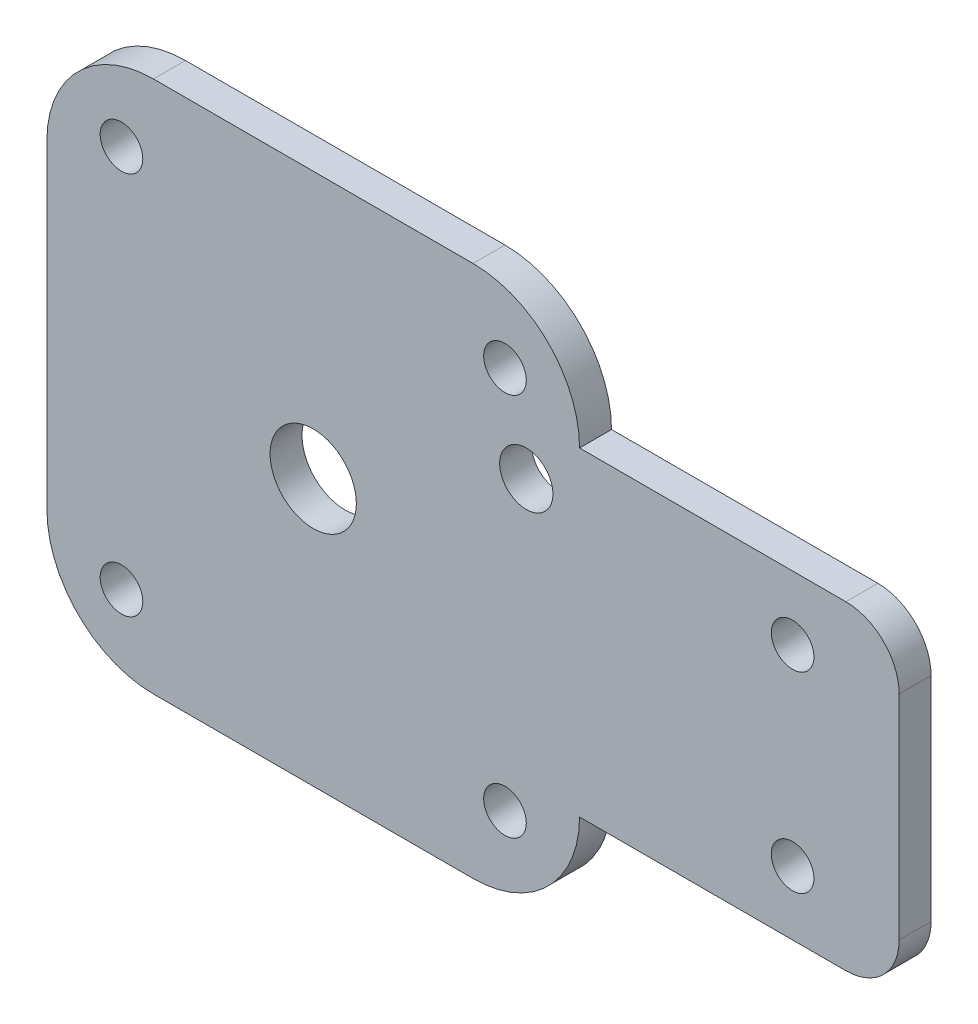
ISO-10303-21;
HEADER;
FILE_DESCRIPTION(('STEP AP214'),'2;1');
FILE_NAME('part.step','',(''),(''),'','','');
FILE_SCHEMA(('AUTOMOTIVE_DESIGN { 1 0 10303 214 1 1 1 1 }'));
ENDSEC;
DATA;
#1=APPLICATION_CONTEXT('core data for automotive mechanical design processes');
#2=APPLICATION_PROTOCOL_DEFINITION('international standard','automotive_design',2000,#1);
#3=PRODUCT_CONTEXT('',#1,'mechanical');
#4=PRODUCT('Part','Part','',(#3));
#5=PRODUCT_RELATED_PRODUCT_CATEGORY('part','',(#4));
#6=PRODUCT_DEFINITION_FORMATION('','',#4);
#7=PRODUCT_DEFINITION_CONTEXT('part definition',#1,'design');
#8=PRODUCT_DEFINITION('design','',#6,#7);
#9=PRODUCT_DEFINITION_SHAPE('','',#8);
#10=(LENGTH_UNIT() NAMED_UNIT(*) SI_UNIT(.MILLI.,.METRE.));
#11=(NAMED_UNIT(*) PLANE_ANGLE_UNIT() SI_UNIT($,.RADIAN.));
#12=(NAMED_UNIT(*) SI_UNIT($,.STERADIAN.) SOLID_ANGLE_UNIT());
#13=UNCERTAINTY_MEASURE_WITH_UNIT(LENGTH_MEASURE(1.E-05),#10,'distance_accuracy_value','');
#14=(GEOMETRIC_REPRESENTATION_CONTEXT(3) GLOBAL_UNCERTAINTY_ASSIGNED_CONTEXT((#13)) GLOBAL_UNIT_ASSIGNED_CONTEXT((#10,
#11,#12)) REPRESENTATION_CONTEXT('',''));
#15=CARTESIAN_POINT('',(0.,0.,0.));
#16=DIRECTION('',(0.,0.,1.));
#17=DIRECTION('',(1.,0.,0.));
#18=AXIS2_PLACEMENT_3D('',#15,#16,#17);
#19=CARTESIAN_POINT('',(10.,40.,3.));
#20=DIRECTION('',(0.,0.,-1.));
#21=DIRECTION('',(-1.,0.,0.));
#22=AXIS2_PLACEMENT_3D('',#19,#20,#21);
#23=CYLINDRICAL_SURFACE('',#22,10.);
#24=CARTESIAN_POINT('',(10.,40.,0.));
#25=DIRECTION('',(0.,0.,1.));
#26=DIRECTION('',(1.,0.,0.));
#27=AXIS2_PLACEMENT_3D('',#24,#25,#26);
#28=CIRCLE('',#27,10.);
#29=CARTESIAN_POINT('',(0.,39.9999999999999,0.));
#30=VERTEX_POINT('',#29);
#31=CARTESIAN_POINT('',(10.0000000000001,50.,0.));
#32=VERTEX_POINT('',#31);
#33=EDGE_CURVE('E179',#30,#32,#28,.F.);
#34=ORIENTED_EDGE('',*,*,#33,.F.);
#35=DIRECTION('',(0.,0.,-1.));
#36=VECTOR('',#35,1.);
#37=CARTESIAN_POINT('',(0.,39.9999999999999,3.));
#38=LINE('',#37,#36);
#39=CARTESIAN_POINT('',(0.,39.9999999999999,3.));
#40=VERTEX_POINT('',#39);
#41=EDGE_CURVE('E11',#40,#30,#38,.T.);
#42=ORIENTED_EDGE('',*,*,#41,.F.);
#43=CARTESIAN_POINT('',(10.,40.,3.));
#44=DIRECTION('',(0.,0.,1.));
#45=DIRECTION('',(1.,0.,0.));
#46=AXIS2_PLACEMENT_3D('',#43,#44,#45);
#47=CIRCLE('',#46,10.);
#48=CARTESIAN_POINT('',(10.0000000000001,50.,3.));
#49=VERTEX_POINT('',#48);
#50=EDGE_CURVE('E267',#40,#49,#47,.F.);
#51=ORIENTED_EDGE('',*,*,#50,.T.);
#52=DIRECTION('',(0.,0.,-1.));
#53=VECTOR('',#52,1.);
#54=CARTESIAN_POINT('',(10.0000000000001,50.,3.));
#55=LINE('',#54,#53);
#56=EDGE_CURVE('E53',#49,#32,#55,.T.);
#57=ORIENTED_EDGE('',*,*,#56,.T.);
#58=EDGE_LOOP('',(#34,#42,#51,#57));
#59=FACE_BOUND('',#58,.T.);
#60=ADVANCED_FACE('F36',(#59),#23,.T.);
#61=CARTESIAN_POINT('',(0.,0.,3.));
#62=DIRECTION('',(-1.,0.,0.));
#63=DIRECTION('',(0.,0.,1.));
#64=AXIS2_PLACEMENT_3D('',#61,#62,#63);
#65=PLANE('',#64);
#66=DIRECTION('',(0.,1.,0.));
#67=VECTOR('',#66,1.);
#68=CARTESIAN_POINT('',(0.,0.,0.));
#69=LINE('',#68,#67);
#70=CARTESIAN_POINT('',(0.,10.0000000000001,0.));
#71=VERTEX_POINT('',#70);
#72=EDGE_CURVE('E181',#71,#30,#69,.T.);
#73=ORIENTED_EDGE('',*,*,#72,.F.);
#74=DIRECTION('',(0.,0.,-1.));
#75=VECTOR('',#74,1.);
#76=CARTESIAN_POINT('',(0.,10.0000000000001,3.));
#77=LINE('',#76,#75);
#78=CARTESIAN_POINT('',(0.,10.0000000000001,3.));
#79=VERTEX_POINT('',#78);
#80=EDGE_CURVE('E45',#79,#71,#77,.T.);
#81=ORIENTED_EDGE('',*,*,#80,.F.);
#82=DIRECTION('',(0.,1.,0.));
#83=VECTOR('',#82,1.);
#84=CARTESIAN_POINT('',(0.,0.,3.));
#85=LINE('',#84,#83);
#86=EDGE_CURVE('E265',#79,#40,#85,.T.);
#87=ORIENTED_EDGE('',*,*,#86,.T.);
#88=ORIENTED_EDGE('',*,*,#41,.T.);
#89=EDGE_LOOP('',(#73,#81,#87,#88));
#90=FACE_BOUND('',#89,.T.);
#91=ADVANCED_FACE('F251',(#90),#65,.T.);
#92=CARTESIAN_POINT('',(10.,10.,3.));
#93=DIRECTION('',(0.,0.,-1.));
#94=DIRECTION('',(-1.,0.,0.));
#95=AXIS2_PLACEMENT_3D('',#92,#93,#94);
#96=CYLINDRICAL_SURFACE('',#95,10.);
#97=CARTESIAN_POINT('',(10.,10.,0.));
#98=DIRECTION('',(0.,0.,1.));
#99=DIRECTION('',(1.,0.,0.));
#100=AXIS2_PLACEMENT_3D('',#97,#98,#99);
#101=CIRCLE('',#100,10.);
#102=CARTESIAN_POINT('',(10.0000000000001,0.,0.));
#103=VERTEX_POINT('',#102);
#104=EDGE_CURVE('E184',#103,#71,#101,.F.);
#105=ORIENTED_EDGE('',*,*,#104,.F.);
#106=DIRECTION('',(0.,0.,-1.));
#107=VECTOR('',#106,1.);
#108=CARTESIAN_POINT('',(10.0000000000001,0.,3.));
#109=LINE('',#108,#107);
#110=CARTESIAN_POINT('',(10.0000000000001,0.,3.));
#111=VERTEX_POINT('',#110);
#112=EDGE_CURVE('E240',#111,#103,#109,.T.);
#113=ORIENTED_EDGE('',*,*,#112,.F.);
#114=CARTESIAN_POINT('',(10.,10.,3.));
#115=DIRECTION('',(0.,0.,1.));
#116=DIRECTION('',(1.,0.,0.));
#117=AXIS2_PLACEMENT_3D('',#114,#115,#116);
#118=CIRCLE('',#117,10.);
#119=EDGE_CURVE('E247',#111,#79,#118,.F.);
#120=ORIENTED_EDGE('',*,*,#119,.T.);
#121=ORIENTED_EDGE('',*,*,#80,.T.);
#122=EDGE_LOOP('',(#105,#113,#120,#121));
#123=FACE_BOUND('',#122,.T.);
#124=ADVANCED_FACE('F245',(#123),#96,.T.);
#125=CARTESIAN_POINT('',(0.,0.,3.));
#126=DIRECTION('',(0.,1.,0.));
#127=DIRECTION('',(0.,0.,1.));
#128=AXIS2_PLACEMENT_3D('',#125,#126,#127);
#129=PLANE('',#128);
#130=DIRECTION('',(1.,0.,0.));
#131=VECTOR('',#130,1.);
#132=CARTESIAN_POINT('',(0.,0.,0.));
#133=LINE('',#132,#131);
#134=CARTESIAN_POINT('',(39.9999999999999,0.,0.));
#135=VERTEX_POINT('',#134);
#136=EDGE_CURVE('E187',#103,#135,#133,.T.);
#137=ORIENTED_EDGE('',*,*,#136,.T.);
#138=DIRECTION('',(0.,0.,-1.));
#139=VECTOR('',#138,1.);
#140=CARTESIAN_POINT('',(39.9999999999999,0.,3.));
#141=LINE('',#140,#139);
#142=CARTESIAN_POINT('',(39.9999999999999,0.,3.));
#143=VERTEX_POINT('',#142);
#144=EDGE_CURVE('E237',#143,#135,#141,.T.);
#145=ORIENTED_EDGE('',*,*,#144,.F.);
#146=DIRECTION('',(1.,0.,0.));
#147=VECTOR('',#146,1.);
#148=CARTESIAN_POINT('',(0.,0.,3.));
#149=LINE('',#148,#147);
#150=EDGE_CURVE('E261',#111,#143,#149,.T.);
#151=ORIENTED_EDGE('',*,*,#150,.F.);
#152=ORIENTED_EDGE('',*,*,#112,.T.);
#153=EDGE_LOOP('',(#137,#145,#151,#152));
#154=FACE_BOUND('',#153,.T.);
#155=ADVANCED_FACE('F258',(#154),#129,.F.);
#156=CARTESIAN_POINT('',(40.,10.,3.));
#157=DIRECTION('',(0.,0.,-1.));
#158=DIRECTION('',(-1.,0.,0.));
#159=AXIS2_PLACEMENT_3D('',#156,#157,#158);
#160=CYLINDRICAL_SURFACE('',#159,10.);
#161=CARTESIAN_POINT('',(40.,10.,0.));
#162=DIRECTION('',(0.,0.,1.));
#163=DIRECTION('',(1.,0.,0.));
#164=AXIS2_PLACEMENT_3D('',#161,#162,#163);
#165=CIRCLE('',#164,10.);
#166=CARTESIAN_POINT('',(50.,10.0000000000001,0.));
#167=VERTEX_POINT('',#166);
#168=EDGE_CURVE('E190',#135,#167,#165,.T.);
#169=ORIENTED_EDGE('',*,*,#168,.T.);
#170=DIRECTION('',(0.,0.,-1.));
#171=VECTOR('',#170,1.);
#172=CARTESIAN_POINT('',(50.,10.0000000000001,3.));
#173=LINE('',#172,#171);
#174=CARTESIAN_POINT('',(50.,10.0000000000001,3.));
#175=VERTEX_POINT('',#174);
#176=EDGE_CURVE('E234',#175,#167,#173,.T.);
#177=ORIENTED_EDGE('',*,*,#176,.F.);
#178=CARTESIAN_POINT('',(40.,10.,3.));
#179=DIRECTION('',(0.,0.,1.));
#180=DIRECTION('',(1.,0.,0.));
#181=AXIS2_PLACEMENT_3D('',#178,#179,#180);
#182=CIRCLE('',#181,10.);
#183=EDGE_CURVE('E263',#143,#175,#182,.T.);
#184=ORIENTED_EDGE('',*,*,#183,.F.);
#185=ORIENTED_EDGE('',*,*,#144,.T.);
#186=EDGE_LOOP('',(#169,#177,#184,#185));
#187=FACE_BOUND('',#186,.T.);
#188=ADVANCED_FACE('F473',(#187),#160,.T.);
#189=CARTESIAN_POINT('',(0.,10.0000000000002,3.));
#190=DIRECTION('',(0.,1.,0.));
#191=DIRECTION('',(-1.,0.,0.));
#192=AXIS2_PLACEMENT_3D('',#189,#190,#191);
#193=PLANE('',#192);
#194=DIRECTION('',(1.,0.,0.));
#195=VECTOR('',#194,1.);
#196=CARTESIAN_POINT('',(0.,10.0000000000002,0.));
#197=LINE('',#196,#195);
#198=CARTESIAN_POINT('',(75.,10.,0.));
#199=VERTEX_POINT('',#198);
#200=EDGE_CURVE('E193',#167,#199,#197,.T.);
#201=ORIENTED_EDGE('',*,*,#200,.T.);
#202=DIRECTION('',(0.,0.,-1.));
#203=VECTOR('',#202,1.);
#204=CARTESIAN_POINT('',(75.,10.,3.));
#205=LINE('',#204,#203);
#206=CARTESIAN_POINT('',(75.,10.,3.));
#207=VERTEX_POINT('',#206);
#208=EDGE_CURVE('E231',#207,#199,#205,.T.);
#209=ORIENTED_EDGE('',*,*,#208,.F.);
#210=DIRECTION('',(1.,0.,0.));
#211=VECTOR('',#210,1.);
#212=CARTESIAN_POINT('',(0.,10.0000000000002,3.));
#213=LINE('',#212,#211);
#214=EDGE_CURVE('E272',#175,#207,#213,.T.);
#215=ORIENTED_EDGE('',*,*,#214,.F.);
#216=ORIENTED_EDGE('',*,*,#176,.T.);
#217=EDGE_LOOP('',(#201,#209,#215,#216));
#218=FACE_BOUND('',#217,.T.);
#219=ADVANCED_FACE('F464',(#218),#193,.F.);
#220=CARTESIAN_POINT('',(75.,15.,3.));
#221=DIRECTION('',(0.,0.,-1.));
#222=DIRECTION('',(-1.,0.,0.));
#223=AXIS2_PLACEMENT_3D('',#220,#221,#222);
#224=CYLINDRICAL_SURFACE('',#223,5.);
#225=CARTESIAN_POINT('',(75.,15.,0.));
#226=DIRECTION('',(0.,0.,1.));
#227=DIRECTION('',(1.,0.,0.));
#228=AXIS2_PLACEMENT_3D('',#225,#226,#227);
#229=CIRCLE('',#228,5.);
#230=CARTESIAN_POINT('',(80.,15.,0.));
#231=VERTEX_POINT('',#230);
#232=EDGE_CURVE('E196',#199,#231,#229,.T.);
#233=ORIENTED_EDGE('',*,*,#232,.T.);
#234=DIRECTION('',(0.,0.,-1.));
#235=VECTOR('',#234,1.);
#236=CARTESIAN_POINT('',(80.,15.,3.));
#237=LINE('',#236,#235);
#238=CARTESIAN_POINT('',(80.,15.,3.));
#239=VERTEX_POINT('',#238);
#240=EDGE_CURVE('E229',#239,#231,#237,.T.);
#241=ORIENTED_EDGE('',*,*,#240,.F.);
#242=CARTESIAN_POINT('',(75.,15.,3.));
#243=DIRECTION('',(0.,0.,1.));
#244=DIRECTION('',(1.,0.,0.));
#245=AXIS2_PLACEMENT_3D('',#242,#243,#244);
#246=CIRCLE('',#245,5.);
#247=EDGE_CURVE('E275',#207,#239,#246,.T.);
#248=ORIENTED_EDGE('',*,*,#247,.F.);
#249=ORIENTED_EDGE('',*,*,#208,.T.);
#250=EDGE_LOOP('',(#233,#241,#248,#249));
#251=FACE_BOUND('',#250,.T.);
#252=ADVANCED_FACE('F455',(#251),#224,.T.);
#253=CARTESIAN_POINT('',(80.,0.,3.));
#254=DIRECTION('',(1.,0.,0.));
#255=DIRECTION('',(0.,0.,-1.));
#256=AXIS2_PLACEMENT_3D('',#253,#254,#255);
#257=PLANE('',#256);
#258=DIRECTION('',(0.,-1.,0.));
#259=VECTOR('',#258,1.);
#260=CARTESIAN_POINT('',(80.,0.,0.));
#261=LINE('',#260,#259);
#262=CARTESIAN_POINT('',(80.,35.,0.));
#263=VERTEX_POINT('',#262);
#264=EDGE_CURVE('E199',#263,#231,#261,.T.);
#265=ORIENTED_EDGE('',*,*,#264,.F.);
#266=DIRECTION('',(0.,0.,-1.));
#267=VECTOR('',#266,1.);
#268=CARTESIAN_POINT('',(80.,35.,3.));
#269=LINE('',#268,#267);
#270=CARTESIAN_POINT('',(80.,35.,3.));
#271=VERTEX_POINT('',#270);
#272=EDGE_CURVE('E227',#271,#263,#269,.T.);
#273=ORIENTED_EDGE('',*,*,#272,.F.);
#274=DIRECTION('',(0.,-1.,0.));
#275=VECTOR('',#274,1.);
#276=CARTESIAN_POINT('',(80.,0.,3.));
#277=LINE('',#276,#275);
#278=EDGE_CURVE('E277',#271,#239,#277,.T.);
#279=ORIENTED_EDGE('',*,*,#278,.T.);
#280=ORIENTED_EDGE('',*,*,#240,.T.);
#281=EDGE_LOOP('',(#265,#273,#279,#280));
#282=FACE_BOUND('',#281,.T.);
#283=ADVANCED_FACE('F447',(#282),#257,.T.);
#284=CARTESIAN_POINT('',(75.,35.,3.));
#285=DIRECTION('',(0.,0.,-1.));
#286=DIRECTION('',(-1.,0.,0.));
#287=AXIS2_PLACEMENT_3D('',#284,#285,#286);
#288=CYLINDRICAL_SURFACE('',#287,5.);
#289=CARTESIAN_POINT('',(75.,35.,0.));
#290=DIRECTION('',(0.,0.,1.));
#291=DIRECTION('',(1.,0.,0.));
#292=AXIS2_PLACEMENT_3D('',#289,#290,#291);
#293=CIRCLE('',#292,5.);
#294=CARTESIAN_POINT('',(75.,40.,0.));
#295=VERTEX_POINT('',#294);
#296=EDGE_CURVE('E202',#295,#263,#293,.F.);
#297=ORIENTED_EDGE('',*,*,#296,.F.);
#298=DIRECTION('',(0.,0.,-1.));
#299=VECTOR('',#298,1.);
#300=CARTESIAN_POINT('',(75.,40.,3.));
#301=LINE('',#300,#299);
#302=CARTESIAN_POINT('',(75.,40.,3.));
#303=VERTEX_POINT('',#302);
#304=EDGE_CURVE('E136',#303,#295,#301,.T.);
#305=ORIENTED_EDGE('',*,*,#304,.F.);
#306=CARTESIAN_POINT('',(75.,35.,3.));
#307=DIRECTION('',(0.,0.,1.));
#308=DIRECTION('',(1.,0.,0.));
#309=AXIS2_PLACEMENT_3D('',#306,#307,#308);
#310=CIRCLE('',#309,5.);
#311=EDGE_CURVE('E147',#303,#271,#310,.F.);
#312=ORIENTED_EDGE('',*,*,#311,.T.);
#313=ORIENTED_EDGE('',*,*,#272,.T.);
#314=EDGE_LOOP('',(#297,#305,#312,#313));
#315=FACE_BOUND('',#314,.T.);
#316=ADVANCED_FACE('F281',(#315),#288,.T.);
#317=CARTESIAN_POINT('',(-1.11022302462515E-13,39.9999999999998,3.));
#318=DIRECTION('',(0.,1.,0.));
#319=DIRECTION('',(-1.,0.,0.));
#320=AXIS2_PLACEMENT_3D('',#317,#318,#319);
#321=PLANE('',#320);
#322=DIRECTION('',(1.,0.,0.));
#323=VECTOR('',#322,1.);
#324=CARTESIAN_POINT('',(-1.11022302462515E-13,39.9999999999998,0.));
#325=LINE('',#324,#323);
#326=CARTESIAN_POINT('',(50.,39.9999999999999,0.));
#327=VERTEX_POINT('',#326);
#328=EDGE_CURVE('E132',#327,#295,#325,.T.);
#329=ORIENTED_EDGE('',*,*,#328,.F.);
#330=DIRECTION('',(0.,0.,-1.));
#331=VECTOR('',#330,1.);
#332=CARTESIAN_POINT('',(50.,39.9999999999999,3.));
#333=LINE('',#332,#331);
#334=CARTESIAN_POINT('',(50.,39.9999999999999,3.));
#335=VERTEX_POINT('',#334);
#336=EDGE_CURVE('E127',#335,#327,#333,.T.);
#337=ORIENTED_EDGE('',*,*,#336,.F.);
#338=DIRECTION('',(1.,0.,0.));
#339=VECTOR('',#338,1.);
#340=CARTESIAN_POINT('',(-1.11022302462515E-13,39.9999999999998,3.));
#341=LINE('',#340,#339);
#342=EDGE_CURVE('E130',#335,#303,#341,.T.);
#343=ORIENTED_EDGE('',*,*,#342,.T.);
#344=ORIENTED_EDGE('',*,*,#304,.T.);
#345=EDGE_LOOP('',(#329,#337,#343,#344));
#346=FACE_BOUND('',#345,.T.);
#347=ADVANCED_FACE('F129',(#346),#321,.T.);
#348=CARTESIAN_POINT('',(40.,40.,3.));
#349=DIRECTION('',(0.,0.,-1.));
#350=DIRECTION('',(-1.,0.,0.));
#351=AXIS2_PLACEMENT_3D('',#348,#349,#350);
#352=CYLINDRICAL_SURFACE('',#351,10.);
#353=CARTESIAN_POINT('',(40.,40.,0.));
#354=DIRECTION('',(0.,0.,1.));
#355=DIRECTION('',(1.,0.,0.));
#356=AXIS2_PLACEMENT_3D('',#353,#354,#355);
#357=CIRCLE('',#356,10.);
#358=CARTESIAN_POINT('',(39.9999999999999,50.,0.));
#359=VERTEX_POINT('',#358);
#360=EDGE_CURVE('E206',#359,#327,#357,.F.);
#361=ORIENTED_EDGE('',*,*,#360,.F.);
#362=DIRECTION('',(0.,0.,-1.));
#363=VECTOR('',#362,1.);
#364=CARTESIAN_POINT('',(39.9999999999999,50.,3.));
#365=LINE('',#364,#363);
#366=CARTESIAN_POINT('',(39.9999999999999,50.,3.));
#367=VERTEX_POINT('',#366);
#368=EDGE_CURVE('E90',#367,#359,#365,.T.);
#369=ORIENTED_EDGE('',*,*,#368,.F.);
#370=CARTESIAN_POINT('',(40.,40.,3.));
#371=DIRECTION('',(0.,0.,1.));
#372=DIRECTION('',(1.,0.,0.));
#373=AXIS2_PLACEMENT_3D('',#370,#371,#372);
#374=CIRCLE('',#373,10.);
#375=EDGE_CURVE('E144',#367,#335,#374,.F.);
#376=ORIENTED_EDGE('',*,*,#375,.T.);
#377=ORIENTED_EDGE('',*,*,#336,.T.);
#378=EDGE_LOOP('',(#361,#369,#376,#377));
#379=FACE_BOUND('',#378,.T.);
#380=ADVANCED_FACE('F149',(#379),#352,.T.);
#381=CARTESIAN_POINT('',(70.,16.,3.));
#382=DIRECTION('',(0.,0.,-1.));
#383=DIRECTION('',(-1.,0.,0.));
#384=AXIS2_PLACEMENT_3D('',#381,#382,#383);
#385=CYLINDRICAL_SURFACE('',#384,2.);
#386=CARTESIAN_POINT('',(70.,16.,3.));
#387=DIRECTION('',(0.,0.,1.));
#388=DIRECTION('',(1.,0.,0.));
#389=AXIS2_PLACEMENT_3D('',#386,#387,#388);
#390=CIRCLE('',#389,2.);
#391=CARTESIAN_POINT('',(72.,16.,3.));
#392=VERTEX_POINT('',#391);
#393=EDGE_CURVE('E161',#392,#392,#390,.T.);
#394=ORIENTED_EDGE('',*,*,#393,.T.);
#395=EDGE_LOOP('',(#394));
#396=FACE_BOUND('',#395,.T.);
#397=CARTESIAN_POINT('',(70.,16.,0.));
#398=DIRECTION('',(0.,0.,1.));
#399=DIRECTION('',(1.,0.,0.));
#400=AXIS2_PLACEMENT_3D('',#397,#398,#399);
#401=CIRCLE('',#400,2.);
#402=CARTESIAN_POINT('',(72.,16.,0.));
#403=VERTEX_POINT('',#402);
#404=EDGE_CURVE('E217',#403,#403,#401,.T.);
#405=ORIENTED_EDGE('',*,*,#404,.F.);
#406=EDGE_LOOP('',(#405));
#407=FACE_BOUND('',#406,.T.);
#408=ADVANCED_FACE('F341',(#396,#407),#385,.F.);
#409=CARTESIAN_POINT('',(7.,7.,3.));
#410=DIRECTION('',(0.,0.,-1.));
#411=DIRECTION('',(-1.,0.,0.));
#412=AXIS2_PLACEMENT_3D('',#409,#410,#411);
#413=CYLINDRICAL_SURFACE('',#412,2.);
#414=CARTESIAN_POINT('',(7.,7.,3.));
#415=DIRECTION('',(0.,0.,1.));
#416=DIRECTION('',(1.,0.,0.));
#417=AXIS2_PLACEMENT_3D('',#414,#415,#416);
#418=CIRCLE('',#417,2.);
#419=CARTESIAN_POINT('',(9.,7.,3.));
#420=VERTEX_POINT('',#419);
#421=EDGE_CURVE('E158',#420,#420,#418,.F.);
#422=ORIENTED_EDGE('',*,*,#421,.F.);
#423=EDGE_LOOP('',(#422));
#424=FACE_BOUND('',#423,.T.);
#425=CARTESIAN_POINT('',(7.,7.,0.));
#426=DIRECTION('',(0.,0.,1.));
#427=DIRECTION('',(1.,0.,0.));
#428=AXIS2_PLACEMENT_3D('',#425,#426,#427);
#429=CIRCLE('',#428,2.);
#430=CARTESIAN_POINT('',(9.,7.,0.));
#431=VERTEX_POINT('',#430);
#432=EDGE_CURVE('E214',#431,#431,#429,.F.);
#433=ORIENTED_EDGE('',*,*,#432,.T.);
#434=EDGE_LOOP('',(#433));
#435=FACE_BOUND('',#434,.T.);
#436=ADVANCED_FACE('F295',(#424,#435),#413,.F.);
#437=CARTESIAN_POINT('',(43.,7.,3.));
#438=DIRECTION('',(0.,0.,-1.));
#439=DIRECTION('',(-1.,0.,0.));
#440=AXIS2_PLACEMENT_3D('',#437,#438,#439);
#441=CYLINDRICAL_SURFACE('',#440,2.);
#442=CARTESIAN_POINT('',(43.,7.,3.));
#443=DIRECTION('',(0.,0.,1.));
#444=DIRECTION('',(1.,0.,0.));
#445=AXIS2_PLACEMENT_3D('',#442,#443,#444);
#446=CIRCLE('',#445,2.);
#447=CARTESIAN_POINT('',(45.,7.,3.));
#448=VERTEX_POINT('',#447);
#449=EDGE_CURVE('E152',#448,#448,#446,.T.);
#450=ORIENTED_EDGE('',*,*,#449,.T.);
#451=EDGE_LOOP('',(#450));
#452=FACE_BOUND('',#451,.T.);
#453=CARTESIAN_POINT('',(43.,7.,0.));
#454=DIRECTION('',(0.,0.,1.));
#455=DIRECTION('',(1.,0.,0.));
#456=AXIS2_PLACEMENT_3D('',#453,#454,#455);
#457=CIRCLE('',#456,2.);
#458=CARTESIAN_POINT('',(45.,7.,0.));
#459=VERTEX_POINT('',#458);
#460=EDGE_CURVE('E211',#459,#459,#457,.T.);
#461=ORIENTED_EDGE('',*,*,#460,.F.);
#462=EDGE_LOOP('',(#461));
#463=FACE_BOUND('',#462,.T.);
#464=ADVANCED_FACE('F286',(#452,#463),#441,.F.);
#465=CARTESIAN_POINT('',(0.,50.,3.));
#466=DIRECTION('',(0.,1.,0.));
#467=DIRECTION('',(0.,0.,1.));
#468=AXIS2_PLACEMENT_3D('',#465,#466,#467);
#469=PLANE('',#468);
#470=DIRECTION('',(1.,0.,0.));
#471=VECTOR('',#470,1.);
#472=CARTESIAN_POINT('',(0.,50.,0.));
#473=LINE('',#472,#471);
#474=EDGE_CURVE('E208',#32,#359,#473,.T.);
#475=ORIENTED_EDGE('',*,*,#474,.F.);
#476=ORIENTED_EDGE('',*,*,#56,.F.);
#477=DIRECTION('',(1.,0.,0.));
#478=VECTOR('',#477,1.);
#479=CARTESIAN_POINT('',(0.,50.,3.));
#480=LINE('',#479,#478);
#481=EDGE_CURVE('E150',#49,#367,#480,.T.);
#482=ORIENTED_EDGE('',*,*,#481,.T.);
#483=ORIENTED_EDGE('',*,*,#368,.T.);
#484=EDGE_LOOP('',(#475,#476,#482,#483));
#485=FACE_BOUND('',#484,.T.);
#486=ADVANCED_FACE('F283',(#485),#469,.T.);
#487=CARTESIAN_POINT('',(7.,43.,3.));
#488=DIRECTION('',(0.,0.,-1.));
#489=DIRECTION('',(-1.,0.,0.));
#490=AXIS2_PLACEMENT_3D('',#487,#488,#489);
#491=CYLINDRICAL_SURFACE('',#490,2.);
#492=CARTESIAN_POINT('',(7.,43.,3.));
#493=DIRECTION('',(0.,0.,1.));
#494=DIRECTION('',(1.,0.,0.));
#495=AXIS2_PLACEMENT_3D('',#492,#493,#494);
#496=CIRCLE('',#495,2.);
#497=CARTESIAN_POINT('',(9.,43.,3.));
#498=VERTEX_POINT('',#497);
#499=EDGE_CURVE('E531',#498,#498,#496,.T.);
#500=ORIENTED_EDGE('',*,*,#499,.T.);
#501=EDGE_LOOP('',(#500));
#502=FACE_BOUND('',#501,.T.);
#503=CARTESIAN_POINT('',(7.,43.,0.));
#504=DIRECTION('',(0.,0.,1.));
#505=DIRECTION('',(1.,0.,0.));
#506=AXIS2_PLACEMENT_3D('',#503,#504,#505);
#507=CIRCLE('',#506,2.);
#508=CARTESIAN_POINT('',(9.,43.,0.));
#509=VERTEX_POINT('',#508);
#510=EDGE_CURVE('E176',#509,#509,#507,.T.);
#511=ORIENTED_EDGE('',*,*,#510,.F.);
#512=EDGE_LOOP('',(#511));
#513=FACE_BOUND('',#512,.T.);
#514=ADVANCED_FACE('F285',(#502,#513),#491,.F.);
#515=CARTESIAN_POINT('',(43.,43.,3.));
#516=DIRECTION('',(0.,0.,-1.));
#517=DIRECTION('',(-1.,0.,0.));
#518=AXIS2_PLACEMENT_3D('',#515,#516,#517);
#519=CYLINDRICAL_SURFACE('',#518,2.);
#520=CARTESIAN_POINT('',(43.,43.,3.));
#521=DIRECTION('',(0.,0.,1.));
#522=DIRECTION('',(1.,0.,0.));
#523=AXIS2_PLACEMENT_3D('',#520,#521,#522);
#524=CIRCLE('',#523,2.);
#525=CARTESIAN_POINT('',(45.,43.,3.));
#526=VERTEX_POINT('',#525);
#527=EDGE_CURVE('E528',#526,#526,#524,.F.);
#528=ORIENTED_EDGE('',*,*,#527,.F.);
#529=EDGE_LOOP('',(#528));
#530=FACE_BOUND('',#529,.T.);
#531=CARTESIAN_POINT('',(43.,43.,0.));
#532=DIRECTION('',(0.,0.,1.));
#533=DIRECTION('',(1.,0.,0.));
#534=AXIS2_PLACEMENT_3D('',#531,#532,#533);
#535=CIRCLE('',#534,2.);
#536=CARTESIAN_POINT('',(45.,43.,0.));
#537=VERTEX_POINT('',#536);
#538=EDGE_CURVE('E173',#537,#537,#535,.F.);
#539=ORIENTED_EDGE('',*,*,#538,.T.);
#540=EDGE_LOOP('',(#539));
#541=FACE_BOUND('',#540,.T.);
#542=ADVANCED_FACE('F292',(#530,#541),#519,.F.);
#543=CARTESIAN_POINT('',(25.,25.,3.));
#544=DIRECTION('',(0.,0.,-1.));
#545=DIRECTION('',(-1.,0.,0.));
#546=AXIS2_PLACEMENT_3D('',#543,#544,#545);
#547=CYLINDRICAL_SURFACE('',#546,4.05);
#548=CARTESIAN_POINT('',(25.,25.,3.));
#549=DIRECTION('',(0.,0.,1.));
#550=DIRECTION('',(1.,0.,0.));
#551=AXIS2_PLACEMENT_3D('',#548,#549,#550);
#552=CIRCLE('',#551,4.05);
#553=CARTESIAN_POINT('',(29.05,25.,3.));
#554=VERTEX_POINT('',#553);
#555=EDGE_CURVE('E320',#554,#554,#552,.T.);
#556=ORIENTED_EDGE('',*,*,#555,.T.);
#557=EDGE_LOOP('',(#556));
#558=FACE_BOUND('',#557,.T.);
#559=CARTESIAN_POINT('',(25.,25.,0.));
#560=DIRECTION('',(0.,0.,1.));
#561=DIRECTION('',(1.,0.,0.));
#562=AXIS2_PLACEMENT_3D('',#559,#560,#561);
#563=CIRCLE('',#562,4.05);
#564=CARTESIAN_POINT('',(29.05,25.,0.));
#565=VERTEX_POINT('',#564);
#566=EDGE_CURVE('E170',#565,#565,#563,.T.);
#567=ORIENTED_EDGE('',*,*,#566,.F.);
#568=EDGE_LOOP('',(#567));
#569=FACE_BOUND('',#568,.T.);
#570=ADVANCED_FACE('F308',(#558,#569),#547,.F.);
#571=CARTESIAN_POINT('',(45.,35.,3.));
#572=DIRECTION('',(0.,0.,-1.));
#573=DIRECTION('',(-1.,0.,0.));
#574=AXIS2_PLACEMENT_3D('',#571,#572,#573);
#575=CYLINDRICAL_SURFACE('',#574,2.5);
#576=CARTESIAN_POINT('',(45.,35.,3.));
#577=DIRECTION('',(0.,0.,1.));
#578=DIRECTION('',(1.,0.,0.));
#579=AXIS2_PLACEMENT_3D('',#576,#577,#578);
#580=CIRCLE('',#579,2.5);
#581=CARTESIAN_POINT('',(47.5,35.,3.));
#582=VERTEX_POINT('',#581);
#583=EDGE_CURVE('E223',#582,#582,#580,.T.);
#584=ORIENTED_EDGE('',*,*,#583,.T.);
#585=EDGE_LOOP('',(#584));
#586=FACE_BOUND('',#585,.T.);
#587=CARTESIAN_POINT('',(45.,35.,0.));
#588=DIRECTION('',(0.,0.,1.));
#589=DIRECTION('',(1.,0.,0.));
#590=AXIS2_PLACEMENT_3D('',#587,#588,#589);
#591=CIRCLE('',#590,2.5);
#592=CARTESIAN_POINT('',(47.5,35.,0.));
#593=VERTEX_POINT('',#592);
#594=EDGE_CURVE('E167',#593,#593,#591,.T.);
#595=ORIENTED_EDGE('',*,*,#594,.F.);
#596=EDGE_LOOP('',(#595));
#597=FACE_BOUND('',#596,.T.);
#598=ADVANCED_FACE('F38',(#586,#597),#575,.F.);
#599=CARTESIAN_POINT('',(70.,34.,3.));
#600=DIRECTION('',(0.,0.,-1.));
#601=DIRECTION('',(-1.,0.,0.));
#602=AXIS2_PLACEMENT_3D('',#599,#600,#601);
#603=CYLINDRICAL_SURFACE('',#602,2.);
#604=CARTESIAN_POINT('',(70.,34.,3.));
#605=DIRECTION('',(0.,0.,1.));
#606=DIRECTION('',(1.,0.,0.));
#607=AXIS2_PLACEMENT_3D('',#604,#605,#606);
#608=CIRCLE('',#607,2.);
#609=CARTESIAN_POINT('',(72.,34.,3.));
#610=VERTEX_POINT('',#609);
#611=EDGE_CURVE('E164',#610,#610,#608,.T.);
#612=ORIENTED_EDGE('',*,*,#611,.T.);
#613=EDGE_LOOP('',(#612));
#614=FACE_BOUND('',#613,.T.);
#615=CARTESIAN_POINT('',(70.,34.,0.));
#616=DIRECTION('',(0.,0.,1.));
#617=DIRECTION('',(1.,0.,0.));
#618=AXIS2_PLACEMENT_3D('',#615,#616,#617);
#619=CIRCLE('',#618,2.);
#620=CARTESIAN_POINT('',(72.,34.,0.));
#621=VERTEX_POINT('',#620);
#622=EDGE_CURVE('E220',#621,#621,#619,.T.);
#623=ORIENTED_EDGE('',*,*,#622,.F.);
#624=EDGE_LOOP('',(#623));
#625=FACE_BOUND('',#624,.T.);
#626=ADVANCED_FACE('F315',(#614,#625),#603,.F.);
#627=CARTESIAN_POINT('',(0.,0.,3.));
#628=DIRECTION('',(0.,0.,1.));
#629=DIRECTION('',(1.,0.,0.));
#630=AXIS2_PLACEMENT_3D('',#627,#628,#629);
#631=PLANE('',#630);
#632=ORIENTED_EDGE('',*,*,#583,.F.);
#633=EDGE_LOOP('',(#632));
#634=FACE_BOUND('',#633,.T.);
#635=ORIENTED_EDGE('',*,*,#555,.F.);
#636=EDGE_LOOP('',(#635));
#637=FACE_BOUND('',#636,.T.);
#638=ORIENTED_EDGE('',*,*,#527,.T.);
#639=EDGE_LOOP('',(#638));
#640=FACE_BOUND('',#639,.T.);
#641=ORIENTED_EDGE('',*,*,#499,.F.);
#642=EDGE_LOOP('',(#641));
#643=FACE_BOUND('',#642,.T.);
#644=ORIENTED_EDGE('',*,*,#50,.F.);
#645=ORIENTED_EDGE('',*,*,#86,.F.);
#646=ORIENTED_EDGE('',*,*,#119,.F.);
#647=ORIENTED_EDGE('',*,*,#150,.T.);
#648=ORIENTED_EDGE('',*,*,#183,.T.);
#649=ORIENTED_EDGE('',*,*,#214,.T.);
#650=ORIENTED_EDGE('',*,*,#247,.T.);
#651=ORIENTED_EDGE('',*,*,#278,.F.);
#652=ORIENTED_EDGE('',*,*,#311,.F.);
#653=ORIENTED_EDGE('',*,*,#342,.F.);
#654=ORIENTED_EDGE('',*,*,#375,.F.);
#655=ORIENTED_EDGE('',*,*,#481,.F.);
#656=EDGE_LOOP('',(#644,#645,#646,#647,#648,#649,#650,#651,#652,#653,#654,#655));
#657=FACE_BOUND('',#656,.T.);
#658=ORIENTED_EDGE('',*,*,#449,.F.);
#659=EDGE_LOOP('',(#658));
#660=FACE_BOUND('',#659,.T.);
#661=ORIENTED_EDGE('',*,*,#421,.T.);
#662=EDGE_LOOP('',(#661));
#663=FACE_BOUND('',#662,.T.);
#664=ORIENTED_EDGE('',*,*,#393,.F.);
#665=EDGE_LOOP('',(#664));
#666=FACE_BOUND('',#665,.T.);
#667=ORIENTED_EDGE('',*,*,#611,.F.);
#668=EDGE_LOOP('',(#667));
#669=FACE_BOUND('',#668,.T.);
#670=ADVANCED_FACE('F141',(#634,#637,#640,#643,#657,#660,#663,#666,#669),#631,.T.);
#671=CARTESIAN_POINT('',(0.,0.,0.));
#672=DIRECTION('',(0.,0.,1.));
#673=DIRECTION('',(1.,0.,0.));
#674=AXIS2_PLACEMENT_3D('',#671,#672,#673);
#675=PLANE('',#674);
#676=ORIENTED_EDGE('',*,*,#594,.T.);
#677=EDGE_LOOP('',(#676));
#678=FACE_BOUND('',#677,.T.);
#679=ORIENTED_EDGE('',*,*,#566,.T.);
#680=EDGE_LOOP('',(#679));
#681=FACE_BOUND('',#680,.T.);
#682=ORIENTED_EDGE('',*,*,#538,.F.);
#683=EDGE_LOOP('',(#682));
#684=FACE_BOUND('',#683,.T.);
#685=ORIENTED_EDGE('',*,*,#510,.T.);
#686=EDGE_LOOP('',(#685));
#687=FACE_BOUND('',#686,.T.);
#688=ORIENTED_EDGE('',*,*,#33,.T.);
#689=ORIENTED_EDGE('',*,*,#474,.T.);
#690=ORIENTED_EDGE('',*,*,#360,.T.);
#691=ORIENTED_EDGE('',*,*,#328,.T.);
#692=ORIENTED_EDGE('',*,*,#296,.T.);
#693=ORIENTED_EDGE('',*,*,#264,.T.);
#694=ORIENTED_EDGE('',*,*,#232,.F.);
#695=ORIENTED_EDGE('',*,*,#200,.F.);
#696=ORIENTED_EDGE('',*,*,#168,.F.);
#697=ORIENTED_EDGE('',*,*,#136,.F.);
#698=ORIENTED_EDGE('',*,*,#104,.T.);
#699=ORIENTED_EDGE('',*,*,#72,.T.);
#700=EDGE_LOOP('',(#688,#689,#690,#691,#692,#693,#694,#695,#696,#697,#698,#699));
#701=FACE_BOUND('',#700,.T.);
#702=ORIENTED_EDGE('',*,*,#460,.T.);
#703=EDGE_LOOP('',(#702));
#704=FACE_BOUND('',#703,.T.);
#705=ORIENTED_EDGE('',*,*,#432,.F.);
#706=EDGE_LOOP('',(#705));
#707=FACE_BOUND('',#706,.T.);
#708=ORIENTED_EDGE('',*,*,#404,.T.);
#709=EDGE_LOOP('',(#708));
#710=FACE_BOUND('',#709,.T.);
#711=ORIENTED_EDGE('',*,*,#622,.T.);
#712=EDGE_LOOP('',(#711));
#713=FACE_BOUND('',#712,.T.);
#714=ADVANCED_FACE('F254',(#678,#681,#684,#687,#701,#704,#707,#710,#713),#675,.F.);
#715=CLOSED_SHELL('',(#60,#91,#124,#155,#188,#219,#252,#283,#316,#347,#380,#408,#436,#464,#486,
#514,#542,#570,#598,#626,#670,#714));
#716=MANIFOLD_SOLID_BREP('B2',#715);
#717=ADVANCED_BREP_SHAPE_REPRESENTATION('',(#18,#716),#14);
#718=SHAPE_DEFINITION_REPRESENTATION(#9,#717);
ENDSEC;
END-ISO-10303-21;
